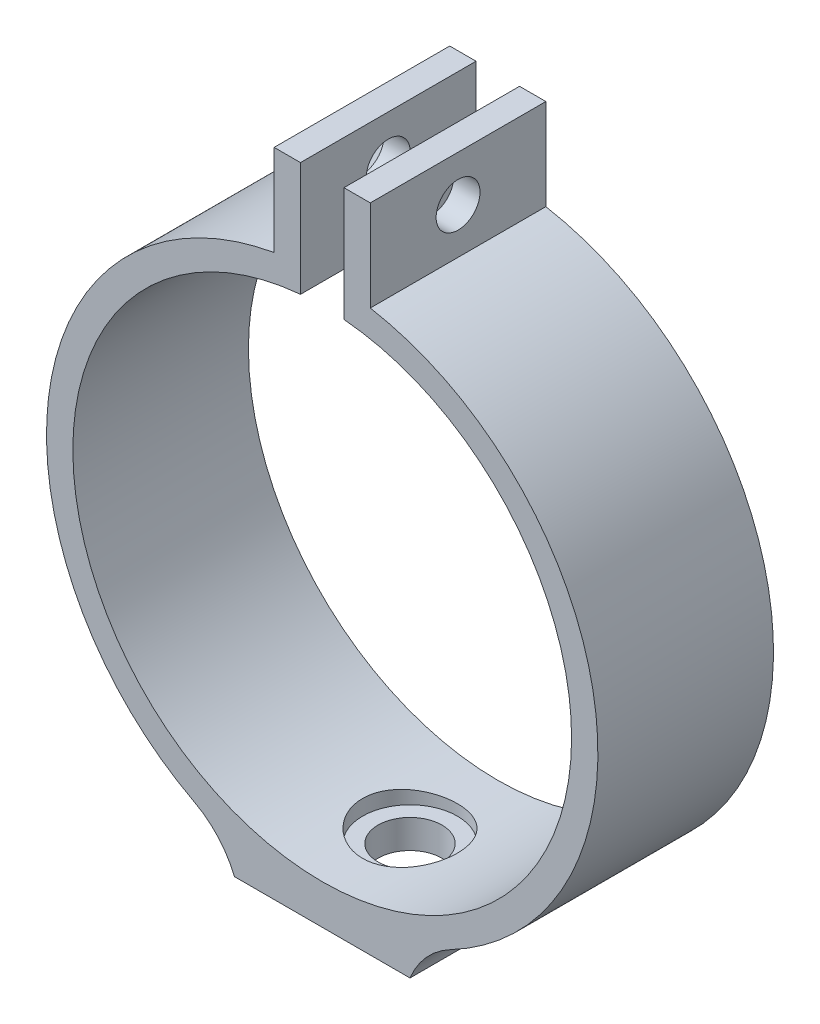
ISO-10303-21;
HEADER;
FILE_DESCRIPTION(('STEP AP214'),'2;1');
FILE_NAME('part.step','',(''),(''),'','','');
FILE_SCHEMA(('AUTOMOTIVE_DESIGN { 1 0 10303 214 1 1 1 1 }'));
ENDSEC;
DATA;
#1=APPLICATION_CONTEXT('core data for automotive mechanical design processes');
#2=APPLICATION_PROTOCOL_DEFINITION('international standard','automotive_design',2000,#1);
#3=PRODUCT_CONTEXT('',#1,'mechanical');
#4=PRODUCT('Part','Part','',(#3));
#5=PRODUCT_RELATED_PRODUCT_CATEGORY('part','',(#4));
#6=PRODUCT_DEFINITION_FORMATION('','',#4);
#7=PRODUCT_DEFINITION_CONTEXT('part definition',#1,'design');
#8=PRODUCT_DEFINITION('design','',#6,#7);
#9=PRODUCT_DEFINITION_SHAPE('','',#8);
#10=(LENGTH_UNIT() NAMED_UNIT(*) SI_UNIT(.MILLI.,.METRE.));
#11=(NAMED_UNIT(*) PLANE_ANGLE_UNIT() SI_UNIT($,.RADIAN.));
#12=(NAMED_UNIT(*) SI_UNIT($,.STERADIAN.) SOLID_ANGLE_UNIT());
#13=UNCERTAINTY_MEASURE_WITH_UNIT(LENGTH_MEASURE(1.E-05),#10,'distance_accuracy_value','');
#14=(GEOMETRIC_REPRESENTATION_CONTEXT(3) GLOBAL_UNCERTAINTY_ASSIGNED_CONTEXT((#13)) GLOBAL_UNIT_ASSIGNED_CONTEXT((#10,
#11,#12)) REPRESENTATION_CONTEXT('',''));
#15=CARTESIAN_POINT('',(0.,0.,0.));
#16=DIRECTION('',(0.,0.,1.));
#17=DIRECTION('',(1.,0.,0.));
#18=AXIS2_PLACEMENT_3D('',#15,#16,#17);
#19=CARTESIAN_POINT('',(0.,0.,20.));
#20=DIRECTION('',(0.,0.,-1.));
#21=DIRECTION('',(-1.,0.,0.));
#22=AXIS2_PLACEMENT_3D('',#19,#20,#21);
#23=CYLINDRICAL_SURFACE('',#22,28.405);
#24=CARTESIAN_POINT('',(0.,0.,0.));
#25=DIRECTION('',(0.,0.,-1.));
#26=DIRECTION('',(1.,0.,0.));
#27=AXIS2_PLACEMENT_3D('',#24,#25,#26);
#28=CIRCLE('',#27,28.405);
#29=CARTESIAN_POINT('',(2.47565887274683,28.2969103992961,0.));
#30=VERTEX_POINT('',#29);
#31=CARTESIAN_POINT('',(-2.47565887274684,28.2969103992961,0.));
#32=VERTEX_POINT('',#31);
#33=EDGE_CURVE('E182',#30,#32,#28,.T.);
#34=ORIENTED_EDGE('',*,*,#33,.T.);
#35=DIRECTION('',(0.,0.,-1.));
#36=VECTOR('',#35,1.);
#37=CARTESIAN_POINT('',(-2.47565887274684,28.2969103992961,20.));
#38=LINE('',#37,#36);
#39=CARTESIAN_POINT('',(-2.47565887274684,28.2969103992961,20.));
#40=VERTEX_POINT('',#39);
#41=EDGE_CURVE('E208',#40,#32,#38,.T.);
#42=ORIENTED_EDGE('',*,*,#41,.F.);
#43=CARTESIAN_POINT('',(0.,0.,20.));
#44=DIRECTION('',(0.,0.,-1.));
#45=DIRECTION('',(1.,0.,0.));
#46=AXIS2_PLACEMENT_3D('',#43,#44,#45);
#47=CIRCLE('',#46,28.405);
#48=CARTESIAN_POINT('',(2.47565887274683,28.2969103992961,20.));
#49=VERTEX_POINT('',#48);
#50=EDGE_CURVE('E162',#49,#40,#47,.T.);
#51=ORIENTED_EDGE('',*,*,#50,.F.);
#52=DIRECTION('',(0.,0.,-1.));
#53=VECTOR('',#52,1.);
#54=CARTESIAN_POINT('',(2.47565887274683,28.2969103992961,20.));
#55=LINE('',#54,#53);
#56=EDGE_CURVE('E211',#49,#30,#55,.T.);
#57=ORIENTED_EDGE('',*,*,#56,.T.);
#58=EDGE_LOOP('',(#34,#42,#51,#57));
#59=FACE_BOUND('',#58,.T.);
#60=CARTESIAN_POINT('',(0.,-28.405,4.6));
#61=CARTESIAN_POINT('',(-0.150260918105486,-28.4050013485932,4.59999722979711));
#62=CARTESIAN_POINT('',(-0.300486291733172,-28.4038055810365,4.60627348552631));
#63=CARTESIAN_POINT('',(-0.599899288939165,-28.3990588343959,4.63132409669231));
#64=CARTESIAN_POINT('',(-0.749086722992093,-28.3955074360226,4.65010067712025));
#65=CARTESIAN_POINT('',(-1.04538456158773,-28.3861442909909,4.70002266531095));
#66=CARTESIAN_POINT('',(-1.19249377149172,-28.3803312950248,4.73117490959822));
#67=CARTESIAN_POINT('',(-1.48356584552922,-28.3666052295897,4.80561788953784));
#68=CARTESIAN_POINT('',(-1.62752753287775,-28.35869138872,4.84891308424189));
#69=CARTESIAN_POINT('',(-1.91105399664303,-28.3409959189255,4.94724250326095));
#70=CARTESIAN_POINT('',(-2.05062423574339,-28.3312167268031,5.00226142314386));
#71=CARTESIAN_POINT('',(-2.32465470639541,-28.3100494506328,5.12368499275693));
#72=CARTESIAN_POINT('',(-2.4591130315743,-28.2986607736898,5.19009384019499));
#73=CARTESIAN_POINT('',(-2.72189402511144,-28.2745949739078,5.33376950591934));
#74=CARTESIAN_POINT('',(-2.85021949962452,-28.2619184488008,5.4110312933203));
#75=CARTESIAN_POINT('',(-3.09999120479249,-28.2356132900117,5.57592301853964));
#76=CARTESIAN_POINT('',(-3.22143484546653,-28.221984302123,5.6635568220478));
#77=CARTESIAN_POINT('',(-3.45784018542351,-28.1940009033639,5.84955401912702));
#78=CARTESIAN_POINT('',(-3.57271908760257,-28.1796403130531,5.94802173340077));
#79=CARTESIAN_POINT('',(-3.79384104393071,-28.1507235401455,6.15427025529103));
#80=CARTESIAN_POINT('',(-3.90008088308203,-28.1361672870605,6.26205449951749));
#81=CARTESIAN_POINT('',(-4.10312599832802,-28.1072748165829,6.48614023451557));
#82=CARTESIAN_POINT('',(-4.19993403472986,-28.0929385358542,6.60243921581093));
#83=CARTESIAN_POINT('',(-4.38351799203802,-28.0648788301096,6.84284101080532));
#84=CARTESIAN_POINT('',(-4.47029019976138,-28.0511556330753,6.9669466868706));
#85=CARTESIAN_POINT('',(-4.63378726753522,-28.0246134115394,7.22308129645175));
#86=CARTESIAN_POINT('',(-4.71042840723523,-28.0118022815472,7.35516451849451));
#87=CARTESIAN_POINT('',(-4.85232375164048,-27.9875715645168,7.62549576853099));
#88=CARTESIAN_POINT('',(-4.91757369020821,-27.9761524993041,7.76374608193959));
#89=CARTESIAN_POINT('',(-5.03613321669165,-27.955053628758,8.04534484861127));
#90=CARTESIAN_POINT('',(-5.08944805010016,-27.9453730597249,8.18869103000754));
#91=CARTESIAN_POINT('',(-5.18377500680696,-27.9280283760436,8.47950944814571));
#92=CARTESIAN_POINT('',(-5.22478265765922,-27.920364994568,8.62698316360624));
#93=CARTESIAN_POINT('',(-5.327931075656,-27.9009371959586,9.07035260539245));
#94=CARTESIAN_POINT('',(-5.37174925205622,-27.8924490391579,9.37089886258582));
#95=CARTESIAN_POINT('',(-5.40842612050692,-27.8853594418342,9.97502246172817));
#96=CARTESIAN_POINT('',(-5.4012895121207,-27.8867570895429,10.2785995215671));
#97=CARTESIAN_POINT('',(-5.33681401585565,-27.8991661679104,10.876021880699));
#98=CARTESIAN_POINT('',(-5.28015705843903,-27.9100470025608,11.1699433191483));
#99=CARTESIAN_POINT('',(-5.11930530796745,-27.9399958142902,11.7440200458569));
#100=CARTESIAN_POINT('',(-5.01510844366916,-27.9590641480844,12.0241747337301));
#101=CARTESIAN_POINT('',(-4.76147561997255,-28.0033741801062,12.5647693074434));
#102=CARTESIAN_POINT('',(-4.61176526509519,-28.028653138989,12.8250772899631));
#103=CARTESIAN_POINT('',(-4.27154786052006,-28.0825119526757,13.3171330545953));
#104=CARTESIAN_POINT('',(-4.08103655844426,-28.1110921514,13.5488778558113));
#105=CARTESIAN_POINT('',(-3.66095298263842,-28.1689016849689,13.9811700231423));
#106=CARTESIAN_POINT('',(-3.43079751703614,-28.1981340318432,14.181150698623));
#107=CARTESIAN_POINT('',(-2.93990752184304,-28.2535286304181,14.5397504765784));
#108=CARTESIAN_POINT('',(-2.67917266918675,-28.2796908496774,14.6983691420141));
#109=CARTESIAN_POINT('',(-2.13392629533508,-28.3260524829819,14.9698301980955));
#110=CARTESIAN_POINT('',(-1.84938412963038,-28.3462440553443,15.0826124605821));
#111=CARTESIAN_POINT('',(-1.26492367018178,-28.3783289881184,15.2586199095572));
#112=CARTESIAN_POINT('',(-0.965007060163031,-28.3902232551305,15.3218505103725));
#113=CARTESIAN_POINT('',(-0.363185565517606,-28.4042485323957,15.3961682250088));
#114=CARTESIAN_POINT('',(-0.0613798188332342,-28.4065248770089,15.4080316065326));
#115=CARTESIAN_POINT('',(0.539902555892428,-28.4014597377524,15.3813620738808));
#116=CARTESIAN_POINT('',(0.839379300937359,-28.3941187402167,15.3428317080384));
#117=CARTESIAN_POINT('',(1.42503184765168,-28.3707343527761,15.2171137341414));
#118=CARTESIAN_POINT('',(1.71129526783297,-28.3547614437132,15.1303200392691));
#119=CARTESIAN_POINT('',(2.26520702871712,-28.315897009418,14.9109662074134));
#120=CARTESIAN_POINT('',(2.53285407660691,-28.2930050042783,14.778402895766));
#121=CARTESIAN_POINT('',(3.04524056476143,-28.2424791644159,14.4695628984911));
#122=CARTESIAN_POINT('',(3.28968990490604,-28.2147950984422,14.2928133064161));
#123=CARTESIAN_POINT('',(3.74573735033974,-28.1578832429611,13.9012554838056));
#124=CARTESIAN_POINT('',(3.95733229243438,-28.1286553051735,13.6864435929211));
#125=CARTESIAN_POINT('',(4.34462401252389,-28.0714659684075,13.2213446360852));
#126=CARTESIAN_POINT('',(4.51979038355462,-28.043527351673,12.9706126677643));
#127=CARTESIAN_POINT('',(4.82551880785676,-27.9925440326985,12.4428147234101));
#128=CARTESIAN_POINT('',(4.95608254678679,-27.9694991455232,12.1657497430811));
#129=CARTESIAN_POINT('',(5.16815789047819,-27.9310898967235,11.5945371287013));
#130=CARTESIAN_POINT('',(5.2499098042656,-27.9156879719123,11.3004811332627));
#131=CARTESIAN_POINT('',(5.36276197544229,-27.8942331681903,10.7023163438913));
#132=CARTESIAN_POINT('',(5.39386812658979,-27.8881792014415,10.3982087238912));
#133=CARTESIAN_POINT('',(5.40179900491757,-27.8866357379322,9.94416350687481));
#134=CARTESIAN_POINT('',(5.39816307802091,-27.8873434049431,9.79433058895375));
#135=CARTESIAN_POINT('',(5.3784644848172,-27.8911506438023,9.49552970349557));
#136=CARTESIAN_POINT('',(5.36240651901282,-27.8942493108945,9.34656143025413));
#137=CARTESIAN_POINT('',(5.31797645553538,-27.9027534734858,9.05049766962131));
#138=CARTESIAN_POINT('',(5.28960001996885,-27.9081597815992,8.90340286076172));
#139=CARTESIAN_POINT('',(5.22076899924793,-27.9211178698477,8.61221732013063));
#140=CARTESIAN_POINT('',(5.18031873458806,-27.9286688824759,8.46812553345774));
#141=CARTESIAN_POINT('',(5.08772001556972,-27.9456855231126,8.18413190184005));
#142=CARTESIAN_POINT('',(5.03559082628803,-27.9551479955555,8.04422358197422));
#143=CARTESIAN_POINT('',(4.92000374789667,-27.97572216287,7.76935352046005));
#144=CARTESIAN_POINT('',(4.85654988222027,-27.986833271778,7.63439004246608));
#145=CARTESIAN_POINT('',(4.71872899603451,-28.0104000037268,7.37020863154315));
#146=CARTESIAN_POINT('',(4.64435752257904,-28.022856174825,7.24099307116229));
#147=CARTESIAN_POINT('',(4.48526916867894,-28.0487588944991,6.98926547184835));
#148=CARTESIAN_POINT('',(4.40055586580035,-28.0622050999556,6.86675113586744));
#149=CARTESIAN_POINT('',(4.21992692837409,-28.0899398131386,6.62730682040538));
#150=CARTESIAN_POINT('',(4.12385581305422,-28.104238254484,6.51049525021224));
#151=CARTESIAN_POINT('',(3.92231113540126,-28.1330740696511,6.28539498937447));
#152=CARTESIAN_POINT('',(3.81684090557024,-28.1476113573093,6.17710330340171));
#153=CARTESIAN_POINT('',(3.59711874283766,-28.1765335748114,5.96966791224636));
#154=CARTESIAN_POINT('',(3.48286163794603,-28.190918409165,5.87052967153516));
#155=CARTESIAN_POINT('',(3.24643608870187,-28.2191219392592,5.68218957611515));
#156=CARTESIAN_POINT('',(3.12427057467436,-28.2329408416325,5.59298407395031));
#157=CARTESIAN_POINT('',(2.87159433333766,-28.2597640451308,5.42427658166756));
#158=CARTESIAN_POINT('',(2.74101417836645,-28.2727591491777,5.34487705853848));
#159=CARTESIAN_POINT('',(2.47354806626658,-28.2974135622461,5.19740965552711));
#160=CARTESIAN_POINT('',(2.3366644553044,-28.3090733627268,5.12933760235814));
#161=CARTESIAN_POINT('',(2.05759117281731,-28.3307237557196,5.0050393817671));
#162=CARTESIAN_POINT('',(1.91540492909931,-28.3407154044626,4.94880571265273));
#163=CARTESIAN_POINT('',(1.62671240392523,-28.358751125584,4.84857674109251));
#164=CARTESIAN_POINT('',(1.48020699132527,-28.3667955867056,4.804578995564));
#165=CARTESIAN_POINT('',(1.11482107621181,-28.3839456910489,4.71158238001141));
#166=CARTESIAN_POINT('',(0.894003937307169,-28.3918013878699,4.66979367864851));
#167=CARTESIAN_POINT('',(0.448764723872899,-28.4023274664825,4.61400492707097));
#168=CARTESIAN_POINT('',(0.224342745616749,-28.4049979865217,4.60000413597182));
#169=CARTESIAN_POINT('',(0.,-28.405,4.6));
#170=B_SPLINE_CURVE_WITH_KNOTS('',3,(#60,#61,#62,#63,#64,#65,#66,#67,#68,#69,#70,#71,#72,#73,
#74,#75,#76,#77,#78,#79,#80,#81,#82,#83,#84,#85,#86,#87,#88,#89,#90,#91,#92,#93,#94,#95,#96,#97,
#98,#99,#100,#101,#102,#103,#104,#105,#106,#107,#108,#109,#110,#111,#112,#113,#114,#115,#116,
#117,#118,#119,#120,#121,#122,#123,#124,#125,#126,#127,#128,#129,#130,#131,#132,#133,#134,#135,
#136,#137,#138,#139,#140,#141,#142,#143,#144,#145,#146,#147,#148,#149,#150,#151,#152,#153,#154,
#155,#156,#157,#158,#159,#160,#161,#162,#163,#164,#165,#166,#167,#168,#169),.UNSPECIFIED.,.T.,
.F.,(4,2,2,2,2,2,2,2,2,2,2,2,2,2,2,2,2,2,2,2,2,2,2,2,2,2,2,2,2,2,2,2,2,2,2,2,2,2,2,2,2,2,2,2,2,
2,2,2,2,2,2,2,2,2,4),(0.,0.450585874727325,0.901251972788563,1.3521673733298,1.80324857324295,
2.253744489459,2.70440679214179,3.15486087529405,3.60548337622107,4.06090450921624,
4.51649435728566,4.97195046957776,5.42757456181927,5.88675539192528,6.34610782339818,
6.80525797083708,7.26457477255454,8.17129171795147,9.0779250378626,9.97226665300877,
10.8666472370157,11.7665306224343,12.6665078416592,13.5810756909175,14.4956532032839,
15.4114266150913,16.3270999497656,17.2288861262186,18.1306267025126,19.0251132899829,
19.9196619331403,20.8242283223581,21.7288817485541,22.6459047939293,23.5628931785954,
24.4753290282273,25.3876586881115,25.8368562012966,26.2858838211246,26.7350696924307,
27.184095019538,27.6323850362625,28.0805161003301,28.5288304533199,28.9769901573241,
29.4322114354838,29.8872719500181,30.3426023957959,30.7977650818494,31.2573408386469,
31.7167469010428,32.1758609669933,32.6348832981253,33.3076355268024,33.98036981824),.UNSPECIFIED.);
#171=CARTESIAN_POINT('',(0.,-28.405,4.6));
#172=VERTEX_POINT('',#171);
#173=EDGE_CURVE('E39',#172,#172,#170,.T.);
#174=ORIENTED_EDGE('',*,*,#173,.F.);
#175=EDGE_LOOP('',(#174));
#176=FACE_BOUND('',#175,.T.);
#177=ADVANCED_FACE('F35',(#59,#176),#23,.F.);
#178=CARTESIAN_POINT('',(0.,0.,20.));
#179=DIRECTION('',(0.,0.,-1.));
#180=DIRECTION('',(-1.,0.,0.));
#181=AXIS2_PLACEMENT_3D('',#178,#179,#180);
#182=CYLINDRICAL_SURFACE('',#181,31.405);
#183=CARTESIAN_POINT('',(0.,0.,20.));
#184=DIRECTION('',(0.,0.,1.));
#185=DIRECTION('',(1.,0.,0.));
#186=AXIS2_PLACEMENT_3D('',#183,#184,#185);
#187=CIRCLE('',#186,31.405);
#188=CARTESIAN_POINT('',(14.619119152682,-27.7948804674474,20.));
#189=VERTEX_POINT('',#188);
#190=CARTESIAN_POINT('',(5.47565887274703,30.9239581054772,20.));
#191=VERTEX_POINT('',#190);
#192=EDGE_CURVE('E129',#189,#191,#187,.T.);
#193=ORIENTED_EDGE('',*,*,#192,.F.);
#194=DIRECTION('',(0.,0.,-1.));
#195=VECTOR('',#194,1.);
#196=CARTESIAN_POINT('',(14.619119152682,-27.7948804674474,20.));
#197=LINE('',#196,#195);
#198=CARTESIAN_POINT('',(14.619119152682,-27.7948804674474,0.));
#199=VERTEX_POINT('',#198);
#200=EDGE_CURVE('E149',#189,#199,#197,.T.);
#201=ORIENTED_EDGE('',*,*,#200,.T.);
#202=CARTESIAN_POINT('',(0.,0.,0.));
#203=DIRECTION('',(0.,0.,1.));
#204=DIRECTION('',(1.,0.,0.));
#205=AXIS2_PLACEMENT_3D('',#202,#203,#204);
#206=CIRCLE('',#205,31.405);
#207=CARTESIAN_POINT('',(5.47565887274703,30.9239581054772,0.));
#208=VERTEX_POINT('',#207);
#209=EDGE_CURVE('E146',#199,#208,#206,.T.);
#210=ORIENTED_EDGE('',*,*,#209,.T.);
#211=DIRECTION('',(0.,0.,-1.));
#212=VECTOR('',#211,1.);
#213=CARTESIAN_POINT('',(5.47565887274703,30.9239581054772,20.));
#214=LINE('',#213,#212);
#215=EDGE_CURVE('E143',#191,#208,#214,.T.);
#216=ORIENTED_EDGE('',*,*,#215,.F.);
#217=EDGE_LOOP('',(#193,#201,#210,#216));
#218=FACE_BOUND('',#217,.T.);
#219=ADVANCED_FACE('F144',(#218),#182,.T.);
#220=CARTESIAN_POINT('',(5.47565887274682,41.2969103992961,20.));
#221=DIRECTION('',(-1.,0.,0.));
#222=DIRECTION('',(0.,-1.,0.));
#223=AXIS2_PLACEMENT_3D('',#220,#221,#222);
#224=PLANE('',#223);
#225=CARTESIAN_POINT('',(5.47565887274693,36.1104342523866,10.));
#226=DIRECTION('',(-1.,0.,0.));
#227=DIRECTION('',(0.,-1.,0.));
#228=AXIS2_PLACEMENT_3D('',#225,#226,#227);
#229=CIRCLE('',#228,2.5);
#230=CARTESIAN_POINT('',(5.47565887274698,33.6104342523866,10.));
#231=VERTEX_POINT('',#230);
#232=EDGE_CURVE('E265',#231,#231,#229,.T.);
#233=ORIENTED_EDGE('',*,*,#232,.T.);
#234=EDGE_LOOP('',(#233));
#235=FACE_BOUND('',#234,.T.);
#236=DIRECTION('',(0.,1.,0.));
#237=VECTOR('',#236,1.);
#238=CARTESIAN_POINT('',(5.47565887274682,41.2969103992961,0.));
#239=LINE('',#238,#237);
#240=CARTESIAN_POINT('',(5.47565887274682,41.2969103992961,0.));
#241=VERTEX_POINT('',#240);
#242=EDGE_CURVE('E176',#208,#241,#239,.T.);
#243=ORIENTED_EDGE('',*,*,#242,.T.);
#244=DIRECTION('',(0.,0.,-1.));
#245=VECTOR('',#244,1.);
#246=CARTESIAN_POINT('',(5.47565887274682,41.2969103992961,20.));
#247=LINE('',#246,#245);
#248=CARTESIAN_POINT('',(5.47565887274682,41.2969103992961,20.));
#249=VERTEX_POINT('',#248);
#250=EDGE_CURVE('E150',#249,#241,#247,.T.);
#251=ORIENTED_EDGE('',*,*,#250,.F.);
#252=DIRECTION('',(0.,1.,0.));
#253=VECTOR('',#252,1.);
#254=CARTESIAN_POINT('',(5.47565887274682,41.2969103992961,20.));
#255=LINE('',#254,#253);
#256=EDGE_CURVE('E133',#191,#249,#255,.T.);
#257=ORIENTED_EDGE('',*,*,#256,.F.);
#258=ORIENTED_EDGE('',*,*,#215,.T.);
#259=EDGE_LOOP('',(#243,#251,#257,#258));
#260=FACE_BOUND('',#259,.T.);
#261=ADVANCED_FACE('F152',(#235,#260),#224,.F.);
#262=CARTESIAN_POINT('',(2.47565887274682,41.2969103992961,20.));
#263=DIRECTION('',(0.,-1.,0.));
#264=DIRECTION('',(1.,0.,0.));
#265=AXIS2_PLACEMENT_3D('',#262,#263,#264);
#266=PLANE('',#265);
#267=DIRECTION('',(-1.,0.,0.));
#268=VECTOR('',#267,1.);
#269=CARTESIAN_POINT('',(2.47565887274682,41.2969103992961,0.));
#270=LINE('',#269,#268);
#271=CARTESIAN_POINT('',(2.47565887274682,41.2969103992961,0.));
#272=VERTEX_POINT('',#271);
#273=EDGE_CURVE('E178',#241,#272,#270,.T.);
#274=ORIENTED_EDGE('',*,*,#273,.T.);
#275=DIRECTION('',(0.,0.,-1.));
#276=VECTOR('',#275,1.);
#277=CARTESIAN_POINT('',(2.47565887274682,41.2969103992961,20.));
#278=LINE('',#277,#276);
#279=CARTESIAN_POINT('',(2.47565887274682,41.2969103992961,20.));
#280=VERTEX_POINT('',#279);
#281=EDGE_CURVE('E214',#280,#272,#278,.T.);
#282=ORIENTED_EDGE('',*,*,#281,.F.);
#283=DIRECTION('',(-1.,0.,0.));
#284=VECTOR('',#283,1.);
#285=CARTESIAN_POINT('',(2.47565887274682,41.2969103992961,20.));
#286=LINE('',#285,#284);
#287=EDGE_CURVE('E155',#249,#280,#286,.T.);
#288=ORIENTED_EDGE('',*,*,#287,.F.);
#289=ORIENTED_EDGE('',*,*,#250,.T.);
#290=EDGE_LOOP('',(#274,#282,#288,#289));
#291=FACE_BOUND('',#290,.T.);
#292=ADVANCED_FACE('F254',(#291),#266,.F.);
#293=CARTESIAN_POINT('',(2.47565887274682,28.2969103992961,20.));
#294=DIRECTION('',(1.,0.,0.));
#295=DIRECTION('',(0.,0.,-1.));
#296=AXIS2_PLACEMENT_3D('',#293,#294,#295);
#297=PLANE('',#296);
#298=CARTESIAN_POINT('',(2.47565887274682,36.1104342523866,10.));
#299=DIRECTION('',(1.,0.,0.));
#300=DIRECTION('',(0.,0.,-1.));
#301=AXIS2_PLACEMENT_3D('',#298,#299,#300);
#302=CIRCLE('',#301,2.5);
#303=CARTESIAN_POINT('',(2.47565887274682,36.1104342523866,7.5));
#304=VERTEX_POINT('',#303);
#305=EDGE_CURVE('E268',#304,#304,#302,.T.);
#306=ORIENTED_EDGE('',*,*,#305,.T.);
#307=EDGE_LOOP('',(#306));
#308=FACE_BOUND('',#307,.T.);
#309=DIRECTION('',(0.,-1.,0.));
#310=VECTOR('',#309,1.);
#311=CARTESIAN_POINT('',(2.47565887274682,28.2969103992961,0.));
#312=LINE('',#311,#310);
#313=EDGE_CURVE('E180',#272,#30,#312,.T.);
#314=ORIENTED_EDGE('',*,*,#313,.T.);
#315=ORIENTED_EDGE('',*,*,#56,.F.);
#316=DIRECTION('',(0.,-1.,0.));
#317=VECTOR('',#316,1.);
#318=CARTESIAN_POINT('',(2.47565887274682,28.2969103992961,20.));
#319=LINE('',#318,#317);
#320=EDGE_CURVE('E157',#280,#49,#319,.T.);
#321=ORIENTED_EDGE('',*,*,#320,.F.);
#322=ORIENTED_EDGE('',*,*,#281,.T.);
#323=EDGE_LOOP('',(#314,#315,#321,#322));
#324=FACE_BOUND('',#323,.T.);
#325=ADVANCED_FACE('F251',(#308,#324),#297,.F.);
#326=CARTESIAN_POINT('',(-2.47565887274684,28.2969103992961,20.));
#327=DIRECTION('',(-1.,0.,0.));
#328=DIRECTION('',(0.,-1.,0.));
#329=AXIS2_PLACEMENT_3D('',#326,#327,#328);
#330=PLANE('',#329);
#331=CARTESIAN_POINT('',(-2.47565887274684,36.1104342523866,10.));
#332=DIRECTION('',(-1.,0.,0.));
#333=DIRECTION('',(0.,-1.,0.));
#334=AXIS2_PLACEMENT_3D('',#331,#332,#333);
#335=CIRCLE('',#334,2.5);
#336=CARTESIAN_POINT('',(-2.47565887274684,33.6104342523866,10.));
#337=VERTEX_POINT('',#336);
#338=EDGE_CURVE('E274',#337,#337,#335,.T.);
#339=ORIENTED_EDGE('',*,*,#338,.T.);
#340=EDGE_LOOP('',(#339));
#341=FACE_BOUND('',#340,.T.);
#342=DIRECTION('',(0.,1.,0.));
#343=VECTOR('',#342,1.);
#344=CARTESIAN_POINT('',(-2.47565887274684,28.2969103992961,0.));
#345=LINE('',#344,#343);
#346=CARTESIAN_POINT('',(-2.47565887274684,41.2969103992961,0.));
#347=VERTEX_POINT('',#346);
#348=EDGE_CURVE('E184',#32,#347,#345,.T.);
#349=ORIENTED_EDGE('',*,*,#348,.T.);
#350=DIRECTION('',(0.,0.,-1.));
#351=VECTOR('',#350,1.);
#352=CARTESIAN_POINT('',(-2.47565887274684,41.2969103992961,20.));
#353=LINE('',#352,#351);
#354=CARTESIAN_POINT('',(-2.47565887274684,41.2969103992961,20.));
#355=VERTEX_POINT('',#354);
#356=EDGE_CURVE('E205',#355,#347,#353,.T.);
#357=ORIENTED_EDGE('',*,*,#356,.F.);
#358=DIRECTION('',(0.,1.,0.));
#359=VECTOR('',#358,1.);
#360=CARTESIAN_POINT('',(-2.47565887274684,28.2969103992961,20.));
#361=LINE('',#360,#359);
#362=EDGE_CURVE('E164',#40,#355,#361,.T.);
#363=ORIENTED_EDGE('',*,*,#362,.F.);
#364=ORIENTED_EDGE('',*,*,#41,.T.);
#365=EDGE_LOOP('',(#349,#357,#363,#364));
#366=FACE_BOUND('',#365,.T.);
#367=ADVANCED_FACE('F249',(#341,#366),#330,.F.);
#368=CARTESIAN_POINT('',(-2.47565887274684,41.2969103992961,20.));
#369=DIRECTION('',(0.,-1.,0.));
#370=DIRECTION('',(1.,0.,0.));
#371=AXIS2_PLACEMENT_3D('',#368,#369,#370);
#372=PLANE('',#371);
#373=DIRECTION('',(-1.,0.,0.));
#374=VECTOR('',#373,1.);
#375=CARTESIAN_POINT('',(-2.47565887274684,41.2969103992961,0.));
#376=LINE('',#375,#374);
#377=CARTESIAN_POINT('',(-5.47565887274684,41.2969103992961,0.));
#378=VERTEX_POINT('',#377);
#379=EDGE_CURVE('E186',#347,#378,#376,.T.);
#380=ORIENTED_EDGE('',*,*,#379,.T.);
#381=DIRECTION('',(0.,0.,-1.));
#382=VECTOR('',#381,1.);
#383=CARTESIAN_POINT('',(-5.47565887274684,41.2969103992961,20.));
#384=LINE('',#383,#382);
#385=CARTESIAN_POINT('',(-5.47565887274684,41.2969103992961,20.));
#386=VERTEX_POINT('',#385);
#387=EDGE_CURVE('E202',#386,#378,#384,.T.);
#388=ORIENTED_EDGE('',*,*,#387,.F.);
#389=DIRECTION('',(-1.,0.,0.));
#390=VECTOR('',#389,1.);
#391=CARTESIAN_POINT('',(-2.47565887274684,41.2969103992961,20.));
#392=LINE('',#391,#390);
#393=EDGE_CURVE('E166',#355,#386,#392,.T.);
#394=ORIENTED_EDGE('',*,*,#393,.F.);
#395=ORIENTED_EDGE('',*,*,#356,.T.);
#396=EDGE_LOOP('',(#380,#388,#394,#395));
#397=FACE_BOUND('',#396,.T.);
#398=ADVANCED_FACE('F307',(#397),#372,.F.);
#399=CARTESIAN_POINT('',(-5.47565887274684,41.2969103992961,20.));
#400=DIRECTION('',(1.,0.,0.));
#401=DIRECTION('',(0.,1.,0.));
#402=AXIS2_PLACEMENT_3D('',#399,#400,#401);
#403=PLANE('',#402);
#404=CARTESIAN_POINT('',(-5.47565887274761,36.1104342523866,10.));
#405=DIRECTION('',(-1.,0.,0.));
#406=DIRECTION('',(0.,-1.,0.));
#407=AXIS2_PLACEMENT_3D('',#404,#405,#406);
#408=CIRCLE('',#407,2.5);
#409=CARTESIAN_POINT('',(-5.47565887274761,33.6104342523866,10.));
#410=VERTEX_POINT('',#409);
#411=EDGE_CURVE('E341',#410,#410,#408,.T.);
#412=ORIENTED_EDGE('',*,*,#411,.F.);
#413=EDGE_LOOP('',(#412));
#414=FACE_BOUND('',#413,.T.);
#415=DIRECTION('',(0.,-1.,0.));
#416=VECTOR('',#415,1.);
#417=CARTESIAN_POINT('',(-5.47565887274684,41.2969103992961,0.));
#418=LINE('',#417,#416);
#419=CARTESIAN_POINT('',(-5.47565887274703,30.9239581054772,0.));
#420=VERTEX_POINT('',#419);
#421=EDGE_CURVE('E188',#378,#420,#418,.T.);
#422=ORIENTED_EDGE('',*,*,#421,.T.);
#423=DIRECTION('',(0.,0.,-1.));
#424=VECTOR('',#423,1.);
#425=CARTESIAN_POINT('',(-5.47565887274703,30.9239581054772,20.));
#426=LINE('',#425,#424);
#427=CARTESIAN_POINT('',(-5.47565887274703,30.9239581054772,20.));
#428=VERTEX_POINT('',#427);
#429=EDGE_CURVE('E199',#428,#420,#426,.T.);
#430=ORIENTED_EDGE('',*,*,#429,.F.);
#431=DIRECTION('',(0.,-1.,0.));
#432=VECTOR('',#431,1.);
#433=CARTESIAN_POINT('',(-5.47565887274684,41.2969103992961,20.));
#434=LINE('',#433,#432);
#435=EDGE_CURVE('E168',#386,#428,#434,.T.);
#436=ORIENTED_EDGE('',*,*,#435,.F.);
#437=ORIENTED_EDGE('',*,*,#387,.T.);
#438=EDGE_LOOP('',(#422,#430,#436,#437));
#439=FACE_BOUND('',#438,.T.);
#440=ADVANCED_FACE('F305',(#414,#439),#403,.F.);
#441=CARTESIAN_POINT('',(0.,0.,20.));
#442=DIRECTION('',(0.,0.,-1.));
#443=DIRECTION('',(-1.,0.,0.));
#444=AXIS2_PLACEMENT_3D('',#441,#442,#443);
#445=CYLINDRICAL_SURFACE('',#444,31.405);
#446=CARTESIAN_POINT('',(0.,0.,0.));
#447=DIRECTION('',(0.,0.,1.));
#448=DIRECTION('',(1.,0.,0.));
#449=AXIS2_PLACEMENT_3D('',#446,#447,#448);
#450=CIRCLE('',#449,31.405);
#451=CARTESIAN_POINT('',(-14.619119152682,-27.7948804674474,0.));
#452=VERTEX_POINT('',#451);
#453=EDGE_CURVE('E190',#420,#452,#450,.T.);
#454=ORIENTED_EDGE('',*,*,#453,.T.);
#455=DIRECTION('',(0.,0.,-1.));
#456=VECTOR('',#455,1.);
#457=CARTESIAN_POINT('',(-14.619119152682,-27.7948804674474,20.));
#458=LINE('',#457,#456);
#459=CARTESIAN_POINT('',(-14.619119152682,-27.7948804674474,20.));
#460=VERTEX_POINT('',#459);
#461=EDGE_CURVE('E56',#452,#460,#458,.F.);
#462=ORIENTED_EDGE('',*,*,#461,.T.);
#463=CARTESIAN_POINT('',(0.,0.,20.));
#464=DIRECTION('',(0.,0.,1.));
#465=DIRECTION('',(1.,0.,0.));
#466=AXIS2_PLACEMENT_3D('',#463,#464,#465);
#467=CIRCLE('',#466,31.405);
#468=EDGE_CURVE('E170',#428,#460,#467,.T.);
#469=ORIENTED_EDGE('',*,*,#468,.F.);
#470=ORIENTED_EDGE('',*,*,#429,.T.);
#471=EDGE_LOOP('',(#454,#462,#469,#470));
#472=FACE_BOUND('',#471,.T.);
#473=ADVANCED_FACE('F301',(#472),#445,.T.);
#474=CARTESIAN_POINT('',(-10.,-32.905,20.));
#475=DIRECTION('',(0.,1.,0.));
#476=DIRECTION('',(0.,0.,1.));
#477=AXIS2_PLACEMENT_3D('',#474,#475,#476);
#478=PLANE('',#477);
#479=CARTESIAN_POINT('',(0.,-32.905,10.));
#480=DIRECTION('',(0.,1.,0.));
#481=DIRECTION('',(-1.,0.,0.));
#482=AXIS2_PLACEMENT_3D('',#479,#480,#481);
#483=CIRCLE('',#482,3.64);
#484=CARTESIAN_POINT('',(-3.64,-32.905,10.));
#485=VERTEX_POINT('',#484);
#486=EDGE_CURVE('E271',#485,#485,#483,.T.);
#487=ORIENTED_EDGE('',*,*,#486,.T.);
#488=EDGE_LOOP('',(#487));
#489=FACE_BOUND('',#488,.T.);
#490=DIRECTION('',(1.,0.,0.));
#491=VECTOR('',#490,1.);
#492=CARTESIAN_POINT('',(-10.,-32.905,0.));
#493=LINE('',#492,#491);
#494=CARTESIAN_POINT('',(-10.,-32.905,0.));
#495=VERTEX_POINT('',#494);
#496=CARTESIAN_POINT('',(10.,-32.905,0.));
#497=VERTEX_POINT('',#496);
#498=EDGE_CURVE('E140',#495,#497,#493,.T.);
#499=ORIENTED_EDGE('',*,*,#498,.T.);
#500=DIRECTION('',(0.,0.,-1.));
#501=VECTOR('',#500,1.);
#502=CARTESIAN_POINT('',(10.,-32.905,20.));
#503=LINE('',#502,#501);
#504=CARTESIAN_POINT('',(10.,-32.905,20.));
#505=VERTEX_POINT('',#504);
#506=EDGE_CURVE('E174',#505,#497,#503,.T.);
#507=ORIENTED_EDGE('',*,*,#506,.F.);
#508=DIRECTION('',(1.,0.,0.));
#509=VECTOR('',#508,1.);
#510=CARTESIAN_POINT('',(-10.,-32.905,20.));
#511=LINE('',#510,#509);
#512=CARTESIAN_POINT('',(-10.,-32.905,20.));
#513=VERTEX_POINT('',#512);
#514=EDGE_CURVE('E172',#513,#505,#511,.T.);
#515=ORIENTED_EDGE('',*,*,#514,.F.);
#516=DIRECTION('',(0.,0.,-1.));
#517=VECTOR('',#516,1.);
#518=CARTESIAN_POINT('',(-10.,-32.905,20.));
#519=LINE('',#518,#517);
#520=EDGE_CURVE('E196',#513,#495,#519,.T.);
#521=ORIENTED_EDGE('',*,*,#520,.T.);
#522=EDGE_LOOP('',(#499,#507,#515,#521));
#523=FACE_BOUND('',#522,.T.);
#524=ADVANCED_FACE('F227',(#489,#523),#478,.F.);
#525=CARTESIAN_POINT('',(0.,0.,20.));
#526=DIRECTION('',(0.,0.,1.));
#527=DIRECTION('',(1.,0.,0.));
#528=AXIS2_PLACEMENT_3D('',#525,#526,#527);
#529=PLANE('',#528);
#530=ORIENTED_EDGE('',*,*,#514,.T.);
#531=CARTESIAN_POINT('',(19.274148336787,-36.6453439183142,20.));
#532=DIRECTION('',(0.,0.,1.));
#533=DIRECTION('',(1.,0.,0.));
#534=AXIS2_PLACEMENT_3D('',#531,#532,#533);
#535=CIRCLE('',#534,10.);
#536=EDGE_CURVE('E136',#505,#189,#535,.F.);
#537=ORIENTED_EDGE('',*,*,#536,.T.);
#538=ORIENTED_EDGE('',*,*,#192,.T.);
#539=ORIENTED_EDGE('',*,*,#256,.T.);
#540=ORIENTED_EDGE('',*,*,#287,.T.);
#541=ORIENTED_EDGE('',*,*,#320,.T.);
#542=ORIENTED_EDGE('',*,*,#50,.T.);
#543=ORIENTED_EDGE('',*,*,#362,.T.);
#544=ORIENTED_EDGE('',*,*,#393,.T.);
#545=ORIENTED_EDGE('',*,*,#435,.T.);
#546=ORIENTED_EDGE('',*,*,#468,.T.);
#547=CARTESIAN_POINT('',(-19.274148336787,-36.6453439183142,20.));
#548=DIRECTION('',(0.,0.,1.));
#549=DIRECTION('',(1.,0.,0.));
#550=AXIS2_PLACEMENT_3D('',#547,#548,#549);
#551=CIRCLE('',#550,10.);
#552=EDGE_CURVE('E12',#460,#513,#551,.F.);
#553=ORIENTED_EDGE('',*,*,#552,.T.);
#554=EDGE_LOOP('',(#530,#537,#538,#539,#540,#541,#542,#543,#544,#545,#546,#553));
#555=FACE_BOUND('',#554,.T.);
#556=ADVANCED_FACE('F131',(#555),#529,.T.);
#557=CARTESIAN_POINT('',(0.,0.,0.));
#558=DIRECTION('',(0.,0.,1.));
#559=DIRECTION('',(1.,0.,0.));
#560=AXIS2_PLACEMENT_3D('',#557,#558,#559);
#561=PLANE('',#560);
#562=ORIENTED_EDGE('',*,*,#209,.F.);
#563=CARTESIAN_POINT('',(19.274148336787,-36.6453439183142,0.));
#564=DIRECTION('',(0.,0.,1.));
#565=DIRECTION('',(1.,0.,0.));
#566=AXIS2_PLACEMENT_3D('',#563,#564,#565);
#567=CIRCLE('',#566,10.);
#568=EDGE_CURVE('E220',#199,#497,#567,.T.);
#569=ORIENTED_EDGE('',*,*,#568,.T.);
#570=ORIENTED_EDGE('',*,*,#498,.F.);
#571=CARTESIAN_POINT('',(-19.274148336787,-36.6453439183142,0.));
#572=DIRECTION('',(0.,0.,1.));
#573=DIRECTION('',(1.,0.,0.));
#574=AXIS2_PLACEMENT_3D('',#571,#572,#573);
#575=CIRCLE('',#574,10.);
#576=EDGE_CURVE('E49',#495,#452,#575,.T.);
#577=ORIENTED_EDGE('',*,*,#576,.T.);
#578=ORIENTED_EDGE('',*,*,#453,.F.);
#579=ORIENTED_EDGE('',*,*,#421,.F.);
#580=ORIENTED_EDGE('',*,*,#379,.F.);
#581=ORIENTED_EDGE('',*,*,#348,.F.);
#582=ORIENTED_EDGE('',*,*,#33,.F.);
#583=ORIENTED_EDGE('',*,*,#313,.F.);
#584=ORIENTED_EDGE('',*,*,#273,.F.);
#585=ORIENTED_EDGE('',*,*,#242,.F.);
#586=EDGE_LOOP('',(#562,#569,#570,#577,#578,#579,#580,#581,#582,#583,#584,#585));
#587=FACE_BOUND('',#586,.T.);
#588=ADVANCED_FACE('F223',(#587),#561,.F.);
#589=CARTESIAN_POINT('',(19.274148336787,-36.6453439183142,20.));
#590=DIRECTION('',(0.,0.,1.));
#591=DIRECTION('',(1.,0.,0.));
#592=AXIS2_PLACEMENT_3D('',#589,#590,#591);
#593=CYLINDRICAL_SURFACE('',#592,10.);
#594=ORIENTED_EDGE('',*,*,#536,.F.);
#595=ORIENTED_EDGE('',*,*,#506,.T.);
#596=ORIENTED_EDGE('',*,*,#568,.F.);
#597=ORIENTED_EDGE('',*,*,#200,.F.);
#598=EDGE_LOOP('',(#594,#595,#596,#597));
#599=FACE_BOUND('',#598,.T.);
#600=ADVANCED_FACE('F230',(#599),#593,.F.);
#601=CARTESIAN_POINT('',(-19.274148336787,-36.6453439183142,20.));
#602=DIRECTION('',(0.,0.,1.));
#603=DIRECTION('',(1.,0.,0.));
#604=AXIS2_PLACEMENT_3D('',#601,#602,#603);
#605=CYLINDRICAL_SURFACE('',#604,10.);
#606=ORIENTED_EDGE('',*,*,#552,.F.);
#607=ORIENTED_EDGE('',*,*,#461,.F.);
#608=ORIENTED_EDGE('',*,*,#576,.F.);
#609=ORIENTED_EDGE('',*,*,#520,.F.);
#610=EDGE_LOOP('',(#606,#607,#608,#609));
#611=FACE_BOUND('',#610,.T.);
#612=ADVANCED_FACE('F37',(#611),#605,.F.);
#613=CARTESIAN_POINT('',(0.,-8.405,10.));
#614=DIRECTION('',(0.,-1.,0.));
#615=DIRECTION('',(0.,0.,-1.));
#616=AXIS2_PLACEMENT_3D('',#613,#614,#615);
#617=CYLINDRICAL_SURFACE('',#616,5.4);
#618=CARTESIAN_POINT('',(0.,-29.635,10.));
#619=DIRECTION('',(0.,1.,0.));
#620=DIRECTION('',(0.,0.,1.));
#621=AXIS2_PLACEMENT_3D('',#618,#619,#620);
#622=CIRCLE('',#621,5.4);
#623=CARTESIAN_POINT('',(0.,-29.635,15.4));
#624=VERTEX_POINT('',#623);
#625=EDGE_CURVE('E279',#624,#624,#622,.F.);
#626=ORIENTED_EDGE('',*,*,#625,.T.);
#627=EDGE_LOOP('',(#626));
#628=FACE_BOUND('',#627,.T.);
#629=ORIENTED_EDGE('',*,*,#173,.T.);
#630=EDGE_LOOP('',(#629));
#631=FACE_BOUND('',#630,.T.);
#632=ADVANCED_FACE('F236',(#628,#631),#617,.F.);
#633=CARTESIAN_POINT('',(-10.,-29.635,20.));
#634=DIRECTION('',(0.,1.,0.));
#635=DIRECTION('',(0.,0.,1.));
#636=AXIS2_PLACEMENT_3D('',#633,#634,#635);
#637=PLANE('',#636);
#638=CARTESIAN_POINT('',(0.,-29.635,10.));
#639=DIRECTION('',(0.,1.,0.));
#640=DIRECTION('',(-1.,0.,0.));
#641=AXIS2_PLACEMENT_3D('',#638,#639,#640);
#642=CIRCLE('',#641,3.64);
#643=CARTESIAN_POINT('',(-3.64,-29.635,10.));
#644=VERTEX_POINT('',#643);
#645=EDGE_CURVE('E267',#644,#644,#642,.T.);
#646=ORIENTED_EDGE('',*,*,#645,.F.);
#647=EDGE_LOOP('',(#646));
#648=FACE_BOUND('',#647,.T.);
#649=ORIENTED_EDGE('',*,*,#625,.F.);
#650=EDGE_LOOP('',(#649));
#651=FACE_BOUND('',#650,.T.);
#652=ADVANCED_FACE('F287',(#648,#651),#637,.T.);
#653=CARTESIAN_POINT('',(0.,-32.905,10.));
#654=DIRECTION('',(0.,1.,0.));
#655=DIRECTION('',(-1.,0.,0.));
#656=AXIS2_PLACEMENT_3D('',#653,#654,#655);
#657=CYLINDRICAL_SURFACE('',#656,3.64);
#658=ORIENTED_EDGE('',*,*,#486,.F.);
#659=EDGE_LOOP('',(#658));
#660=FACE_BOUND('',#659,.T.);
#661=ORIENTED_EDGE('',*,*,#645,.T.);
#662=EDGE_LOOP('',(#661));
#663=FACE_BOUND('',#662,.T.);
#664=ADVANCED_FACE('F291',(#660,#663),#657,.F.);
#665=CARTESIAN_POINT('',(31.405,36.1104342523866,10.));
#666=DIRECTION('',(-1.,0.,0.));
#667=DIRECTION('',(0.,-1.,0.));
#668=AXIS2_PLACEMENT_3D('',#665,#666,#667);
#669=CYLINDRICAL_SURFACE('',#668,2.5);
#670=ORIENTED_EDGE('',*,*,#411,.T.);
#671=EDGE_LOOP('',(#670));
#672=FACE_BOUND('',#671,.T.);
#673=ORIENTED_EDGE('',*,*,#338,.F.);
#674=EDGE_LOOP('',(#673));
#675=FACE_BOUND('',#674,.T.);
#676=ADVANCED_FACE('F346',(#672,#675),#669,.F.);
#677=ORIENTED_EDGE('',*,*,#305,.F.);
#678=EDGE_LOOP('',(#677));
#679=FACE_BOUND('',#678,.T.);
#680=ORIENTED_EDGE('',*,*,#232,.F.);
#681=EDGE_LOOP('',(#680));
#682=FACE_BOUND('',#681,.T.);
#683=ADVANCED_FACE('F348',(#679,#682),#669,.F.);
#684=CLOSED_SHELL('',(#177,#219,#261,#292,#325,#367,#398,#440,#473,#524,#556,#588,#600,#612,
#632,#652,#664,#676,#683));
#685=MANIFOLD_SOLID_BREP('B2',#684);
#686=ADVANCED_BREP_SHAPE_REPRESENTATION('',(#18,#685),#14);
#687=SHAPE_DEFINITION_REPRESENTATION(#9,#686);
ENDSEC;
END-ISO-10303-21;
